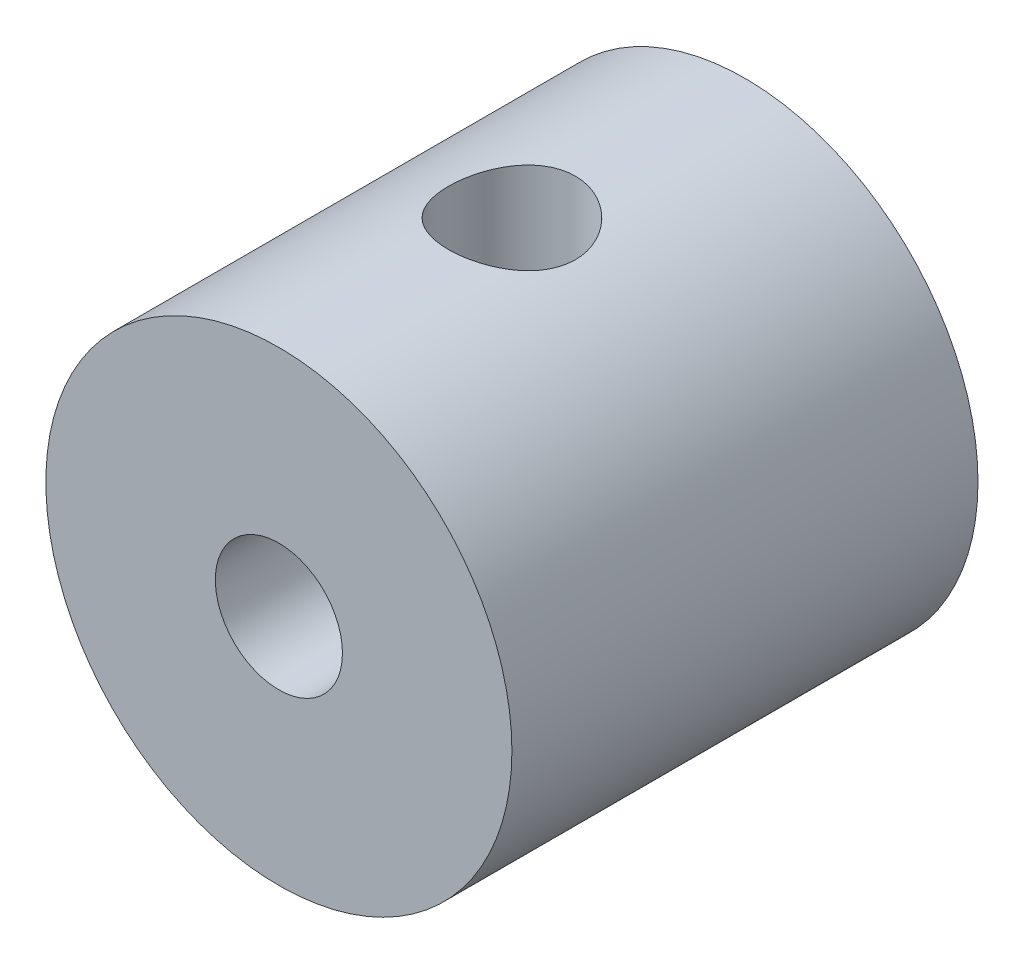
ISO-10303-21;
HEADER;
FILE_DESCRIPTION(('STEP AP214'),'2;1');
FILE_NAME('part.step','',(''),(''),'','','');
FILE_SCHEMA(('AUTOMOTIVE_DESIGN { 1 0 10303 214 1 1 1 1 }'));
ENDSEC;
DATA;
#1=APPLICATION_CONTEXT('core data for automotive mechanical design processes');
#2=APPLICATION_PROTOCOL_DEFINITION('international standard','automotive_design',2000,#1);
#3=PRODUCT_CONTEXT('',#1,'mechanical');
#4=PRODUCT('Part','Part','',(#3));
#5=PRODUCT_RELATED_PRODUCT_CATEGORY('part','',(#4));
#6=PRODUCT_DEFINITION_FORMATION('','',#4);
#7=PRODUCT_DEFINITION_CONTEXT('part definition',#1,'design');
#8=PRODUCT_DEFINITION('design','',#6,#7);
#9=PRODUCT_DEFINITION_SHAPE('','',#8);
#10=(LENGTH_UNIT() NAMED_UNIT(*) SI_UNIT(.MILLI.,.METRE.));
#11=(NAMED_UNIT(*) PLANE_ANGLE_UNIT() SI_UNIT($,.RADIAN.));
#12=(NAMED_UNIT(*) SI_UNIT($,.STERADIAN.) SOLID_ANGLE_UNIT());
#13=UNCERTAINTY_MEASURE_WITH_UNIT(LENGTH_MEASURE(1.E-05),#10,'distance_accuracy_value','');
#14=(GEOMETRIC_REPRESENTATION_CONTEXT(3) GLOBAL_UNCERTAINTY_ASSIGNED_CONTEXT((#13)) GLOBAL_UNIT_ASSIGNED_CONTEXT((#10,
#11,#12)) REPRESENTATION_CONTEXT('',''));
#15=CARTESIAN_POINT('',(0.,0.,0.));
#16=DIRECTION('',(0.,0.,1.));
#17=DIRECTION('',(1.,0.,0.));
#18=AXIS2_PLACEMENT_3D('',#15,#16,#17);
#19=CARTESIAN_POINT('',(0.,0.,5.5));
#20=DIRECTION('',(0.,0.,-1.));
#21=DIRECTION('',(-1.,0.,0.));
#22=AXIS2_PLACEMENT_3D('',#19,#20,#21);
#23=CYLINDRICAL_SURFACE('',#22,0.75);
#24=CARTESIAN_POINT('',(0.,0.,2.75));
#25=DIRECTION('',(0.,0.707106781186547,-0.707106781186547));
#26=DIRECTION('',(0.,-0.707106781186547,-0.707106781186547));
#27=AXIS2_PLACEMENT_3D('',#24,#25,#26);
#28=ELLIPSE('',#27,1.06066017177982,0.75);
#29=CARTESIAN_POINT('',(0.75,0.,2.75));
#30=VERTEX_POINT('',#29);
#31=CARTESIAN_POINT('',(-0.750000000000001,0.,2.75));
#32=VERTEX_POINT('',#31);
#33=EDGE_CURVE('E11',#30,#32,#28,.F.);
#34=ORIENTED_EDGE('',*,*,#33,.F.);
#35=CARTESIAN_POINT('',(0.,0.,2.75));
#36=DIRECTION('',(0.,-0.707106781186547,-0.707106781186547));
#37=DIRECTION('',(0.,0.707106781186547,-0.707106781186547));
#38=AXIS2_PLACEMENT_3D('',#35,#36,#37);
#39=ELLIPSE('',#38,1.06066017177982,0.75);
#40=EDGE_CURVE('E49',#32,#30,#39,.F.);
#41=ORIENTED_EDGE('',*,*,#40,.F.);
#42=EDGE_LOOP('',(#34,#41));
#43=FACE_BOUND('',#42,.T.);
#44=CARTESIAN_POINT('',(0.,0.,5.5));
#45=DIRECTION('',(0.,0.,1.));
#46=DIRECTION('',(1.,0.,0.));
#47=AXIS2_PLACEMENT_3D('',#44,#45,#46);
#48=CIRCLE('',#47,0.75);
#49=CARTESIAN_POINT('',(0.75,0.,5.5));
#50=VERTEX_POINT('',#49);
#51=EDGE_CURVE('E72',#50,#50,#48,.T.);
#52=ORIENTED_EDGE('',*,*,#51,.T.);
#53=EDGE_LOOP('',(#52));
#54=FACE_BOUND('',#53,.T.);
#55=ADVANCED_FACE('F34',(#43,#54),#23,.F.);
#56=CARTESIAN_POINT('',(0.,0.,5.5));
#57=DIRECTION('',(0.,0.,1.));
#58=DIRECTION('',(1.,0.,0.));
#59=AXIS2_PLACEMENT_3D('',#56,#57,#58);
#60=PLANE('',#59);
#61=CARTESIAN_POINT('',(0.,0.,5.5));
#62=DIRECTION('',(0.,0.,1.));
#63=DIRECTION('',(1.,0.,0.));
#64=AXIS2_PLACEMENT_3D('',#61,#62,#63);
#65=CIRCLE('',#64,2.75);
#66=CARTESIAN_POINT('',(2.75,0.,5.5));
#67=VERTEX_POINT('',#66);
#68=EDGE_CURVE('E63',#67,#67,#65,.T.);
#69=ORIENTED_EDGE('',*,*,#68,.T.);
#70=EDGE_LOOP('',(#69));
#71=FACE_BOUND('',#70,.T.);
#72=ORIENTED_EDGE('',*,*,#51,.F.);
#73=EDGE_LOOP('',(#72));
#74=FACE_BOUND('',#73,.T.);
#75=ADVANCED_FACE('F97',(#71,#74),#60,.T.);
#76=CARTESIAN_POINT('',(0.,0.,0.));
#77=DIRECTION('',(0.,0.,1.));
#78=DIRECTION('',(1.,0.,0.));
#79=AXIS2_PLACEMENT_3D('',#76,#77,#78);
#80=PLANE('',#79);
#81=CARTESIAN_POINT('',(0.,0.,0.));
#82=DIRECTION('',(0.,0.,1.));
#83=DIRECTION('',(1.,0.,0.));
#84=AXIS2_PLACEMENT_3D('',#81,#82,#83);
#85=CIRCLE('',#84,2.75);
#86=CARTESIAN_POINT('',(2.75,0.,0.));
#87=VERTEX_POINT('',#86);
#88=EDGE_CURVE('E69',#87,#87,#85,.T.);
#89=ORIENTED_EDGE('',*,*,#88,.F.);
#90=EDGE_LOOP('',(#89));
#91=FACE_BOUND('',#90,.T.);
#92=CARTESIAN_POINT('',(0.,0.,0.));
#93=DIRECTION('',(0.,0.,1.));
#94=DIRECTION('',(1.,0.,0.));
#95=AXIS2_PLACEMENT_3D('',#92,#93,#94);
#96=CIRCLE('',#95,0.75);
#97=CARTESIAN_POINT('',(0.75,0.,0.));
#98=VERTEX_POINT('',#97);
#99=EDGE_CURVE('E75',#98,#98,#96,.T.);
#100=ORIENTED_EDGE('',*,*,#99,.T.);
#101=EDGE_LOOP('',(#100));
#102=FACE_BOUND('',#101,.T.);
#103=ADVANCED_FACE('F99',(#91,#102),#80,.F.);
#104=CARTESIAN_POINT('',(0.,0.,5.5));
#105=DIRECTION('',(0.,0.,-1.));
#106=DIRECTION('',(-1.,0.,0.));
#107=AXIS2_PLACEMENT_3D('',#104,#105,#106);
#108=CYLINDRICAL_SURFACE('',#107,2.75);
#109=CARTESIAN_POINT('',(0.,-2.75,3.5));
#110=CARTESIAN_POINT('',(0.041310456666096,-2.74999941358706,3.49999909369449));
#111=CARTESIAN_POINT('',(0.0826304894063532,-2.74906003630382,3.49657546820829));
#112=CARTESIAN_POINT('',(0.164077965078848,-2.74540399042724,3.48299708484841));
#113=CARTESIAN_POINT('',(0.204204863988631,-2.74268652370244,3.4728393041857));
#114=CARTESIAN_POINT('',(0.282078813027697,-2.73577386087073,3.44614913413079));
#115=CARTESIAN_POINT('',(0.319828933485082,-2.73158061934716,3.42962517366904));
#116=CARTESIAN_POINT('',(0.392022248079858,-2.72215827206405,3.39070353366879));
#117=CARTESIAN_POINT('',(0.426465181644885,-2.71692908478188,3.36830539182306));
#118=CARTESIAN_POINT('',(0.491898473786633,-2.70585698521101,3.31770008176635));
#119=CARTESIAN_POINT('',(0.52279756458498,-2.70000320745485,3.28937727957281));
#120=CARTESIAN_POINT('',(0.579471468412378,-2.68841056467261,3.22797368198514));
#121=CARTESIAN_POINT('',(0.605245589123563,-2.68267171526591,3.19489224479917));
#122=CARTESIAN_POINT('',(0.651388972697531,-2.67184692082858,3.12417437620993));
#123=CARTESIAN_POINT('',(0.671652134188099,-2.66677465033183,3.08646642753061));
#124=CARTESIAN_POINT('',(0.705514581805969,-2.65801753702088,3.00801808590157));
#125=CARTESIAN_POINT('',(0.719115159733594,-2.65433242528424,2.96727828256044));
#126=CARTESIAN_POINT('',(0.738947282206019,-2.64887923610509,2.88493605249306));
#127=CARTESIAN_POINT('',(0.745344802717187,-2.64706806194024,2.84337652591006));
#128=CARTESIAN_POINT('',(0.751106822046827,-2.64543914593961,2.75973765848456));
#129=CARTESIAN_POINT('',(0.750472700704347,-2.64562101300361,2.71765842124518));
#130=CARTESIAN_POINT('',(0.742320958901175,-2.6479191242441,2.63547922451759));
#131=CARTESIAN_POINT('',(0.735005368344572,-2.64997859153265,2.59535738269908));
#132=CARTESIAN_POINT('',(0.714022419359122,-2.655708779006,2.5169333569884));
#133=CARTESIAN_POINT('',(0.70035453252326,-2.65937963323038,2.4786313247668));
#134=CARTESIAN_POINT('',(0.666893149132326,-2.6679680914519,2.40441323972632));
#135=CARTESIAN_POINT('',(0.64702975941473,-2.67289979881809,2.3685303994832));
#136=CARTESIAN_POINT('',(0.601789940110875,-2.68344684399157,2.30053677629515));
#137=CARTESIAN_POINT('',(0.576412380531045,-2.68906232181696,2.26842676858063));
#138=CARTESIAN_POINT('',(0.519836733414477,-2.70057947495229,2.20773740509679));
#139=CARTESIAN_POINT('',(0.488469323083624,-2.70648437148538,2.17931627535553));
#140=CARTESIAN_POINT('',(0.421341005894317,-2.71774323854009,2.12810451751111));
#141=CARTESIAN_POINT('',(0.385579909859276,-2.72309718532152,2.10531413197519));
#142=CARTESIAN_POINT('',(0.31042697686981,-2.73268639060625,2.06593666361254));
#143=CARTESIAN_POINT('',(0.271018818708885,-2.73691625643651,2.04937933070803));
#144=CARTESIAN_POINT('',(0.189836344357194,-2.74374178071307,2.02317101374293));
#145=CARTESIAN_POINT('',(0.14806257215884,-2.74633781322282,2.01351844877793));
#146=CARTESIAN_POINT('',(0.0646840852416241,-2.74954614388156,2.00164469110151));
#147=CARTESIAN_POINT('',(0.0231121488919887,-2.75021581562686,1.99920850233982));
#148=CARTESIAN_POINT('',(-0.0598466828189875,-2.74966150792568,2.00124137375671));
#149=CARTESIAN_POINT('',(-0.101233597766255,-2.74843773391499,2.00570968480824));
#150=CARTESIAN_POINT('',(-0.181872548869779,-2.74427119632979,2.02124875135157));
#151=CARTESIAN_POINT('',(-0.221149662136339,-2.74135993236064,2.0321985963785));
#152=CARTESIAN_POINT('',(-0.297304933724317,-2.73414961767822,2.06024862232024));
#153=CARTESIAN_POINT('',(-0.334182825652499,-2.72985041317236,2.07734948483064));
#154=CARTESIAN_POINT('',(-0.405320580597296,-2.72020786914138,2.11760822114284));
#155=CARTESIAN_POINT('',(-0.439512301206293,-2.7148451477494,2.14088174363078));
#156=CARTESIAN_POINT('',(-0.50358011006541,-2.70369494205017,2.19268064377262));
#157=CARTESIAN_POINT('',(-0.533455303088816,-2.69790737000524,2.22120710807876));
#158=CARTESIAN_POINT('',(-0.588955301721564,-2.68634700779248,2.28370701901744));
#159=CARTESIAN_POINT('',(-0.61442813873611,-2.68057972491943,2.31781669113948));
#160=CARTESIAN_POINT('',(-0.6592929110398,-2.66990013093907,2.38994932360963));
#161=CARTESIAN_POINT('',(-0.678685089629618,-2.6649877856273,2.42797212730376));
#162=CARTESIAN_POINT('',(-0.710692791586048,-2.65663124351908,2.50667031412098));
#163=CARTESIAN_POINT('',(-0.723346761534928,-2.65317874101126,2.54732913026261));
#164=CARTESIAN_POINT('',(-0.741604586103459,-2.64813407348094,2.63030841901378));
#165=CARTESIAN_POINT('',(-0.747210344315742,-2.64654140615938,2.67262843977683));
#166=CARTESIAN_POINT('',(-0.75109947788454,-2.64544004835881,2.75616920190872));
#167=CARTESIAN_POINT('',(-0.749627666085129,-2.64586168000794,2.79737779436125));
#168=CARTESIAN_POINT('',(-0.73997418821988,-2.64857750868493,2.87893532386749));
#169=CARTESIAN_POINT('',(-0.731792710142834,-2.65087165324946,2.91928428497352));
#170=CARTESIAN_POINT('',(-0.709097042175596,-2.65703158245899,2.99765315788806));
#171=CARTESIAN_POINT('',(-0.694636977245637,-2.66088391562909,3.03568987662088));
#172=CARTESIAN_POINT('',(-0.659836522706929,-2.66972594993982,3.10882663840667));
#173=CARTESIAN_POINT('',(-0.639495172522282,-2.67471583684613,3.14392620053259));
#174=CARTESIAN_POINT('',(-0.592777154924258,-2.68546189690907,3.21135529884632));
#175=CARTESIAN_POINT('',(-0.566234509110625,-2.6912368792263,3.24356685242156));
#176=CARTESIAN_POINT('',(-0.508180055996369,-2.70279995245427,3.3031582033973));
#177=CARTESIAN_POINT('',(-0.476667029693998,-2.70858804623652,3.33053681200267));
#178=CARTESIAN_POINT('',(-0.40870386284304,-2.71968229588679,3.3802973072597));
#179=CARTESIAN_POINT('',(-0.37215793313126,-2.72497453876903,3.40255174043349));
#180=CARTESIAN_POINT('',(-0.29569994991964,-2.73432631890201,3.44056621810574));
#181=CARTESIAN_POINT('',(-0.255789976210611,-2.73838661075599,3.45633024027716));
#182=CARTESIAN_POINT('',(-0.180050050609106,-2.74432096997879,3.4789697549895));
#183=CARTESIAN_POINT('',(-0.144532320131234,-2.74643473840546,3.48683727562085));
#184=CARTESIAN_POINT('',(-0.0726788039707427,-2.74927443582177,3.49735251265941));
#185=CARTESIAN_POINT('',(-0.0363431077824743,-2.7500005159001,3.5000007973274));
#186=CARTESIAN_POINT('',(0.,-2.75,3.5));
#187=B_SPLINE_CURVE_WITH_KNOTS('',3,(#109,#110,#111,#112,#113,#114,#115,#116,#117,#118,#119,
#120,#121,#122,#123,#124,#125,#126,#127,#128,#129,#130,#131,#132,#133,#134,#135,#136,#137,#138,
#139,#140,#141,#142,#143,#144,#145,#146,#147,#148,#149,#150,#151,#152,#153,#154,#155,#156,#157,
#158,#159,#160,#161,#162,#163,#164,#165,#166,#167,#168,#169,#170,#171,#172,#173,#174,#175,#176,
#177,#178,#179,#180,#181,#182,#183,#184,#185,#186),.UNSPECIFIED.,.T.,.F.,(4,2,2,2,2,2,2,2,2,2,2,
2,2,2,2,2,2,2,2,2,2,2,2,2,2,2,2,2,2,2,2,2,2,2,2,2,2,2,4),(0.,0.123798053427449,0.24765171427565,
0.37134195121029,0.495041925682353,0.621429391115893,0.747833918296619,0.876522968251097,
1.00518705695498,1.1308215242927,1.25643133845851,1.37836443335025,1.50030767289441,
1.62367963381546,1.74707690067143,1.8746926427297,2.00231388139794,2.13053674865596,
2.25873024881054,2.38306405669123,2.50738437550207,2.6294555559768,2.751540267355,
2.87609734502423,3.00068021825584,3.12895036530017,3.25721537931538,3.38474048225284,
3.51223113559687,3.63534426111897,3.75845393742376,3.88052277825491,4.00261156756375,
4.12844505693628,4.25430945550069,4.38302936142112,4.511670263013,4.62059416044177,
4.72950619778235),.UNSPECIFIED.);
#188=CARTESIAN_POINT('',(0.,-2.75,3.5));
#189=VERTEX_POINT('',#188);
#190=EDGE_CURVE('E78',#189,#189,#187,.T.);
#191=ORIENTED_EDGE('',*,*,#190,.T.);
#192=EDGE_LOOP('',(#191));
#193=FACE_BOUND('',#192,.T.);
#194=CARTESIAN_POINT('',(0.,2.75,3.5));
#195=CARTESIAN_POINT('',(-0.0413104566660967,2.74999941358706,3.49999909369449));
#196=CARTESIAN_POINT('',(-0.0826304894063539,2.74906003630382,3.49657546820829));
#197=CARTESIAN_POINT('',(-0.164077965078849,2.74540399042724,3.48299708484841));
#198=CARTESIAN_POINT('',(-0.204204863988632,2.74268652370244,3.4728393041857));
#199=CARTESIAN_POINT('',(-0.282078813027698,2.73577386087073,3.44614913413079));
#200=CARTESIAN_POINT('',(-0.319828933485082,2.73158061934716,3.42962517366904));
#201=CARTESIAN_POINT('',(-0.392022248079859,2.72215827206405,3.3907035336688));
#202=CARTESIAN_POINT('',(-0.426465181644886,2.71692908478188,3.36830539182306));
#203=CARTESIAN_POINT('',(-0.491898473786634,2.70585698521101,3.31770008176635));
#204=CARTESIAN_POINT('',(-0.522797564584981,2.70000320745485,3.28937727957281));
#205=CARTESIAN_POINT('',(-0.579471468412379,2.68841056467261,3.22797368198514));
#206=CARTESIAN_POINT('',(-0.605245589123564,2.68267171526591,3.19489224479917));
#207=CARTESIAN_POINT('',(-0.651388972697532,2.67184692082858,3.12417437620993));
#208=CARTESIAN_POINT('',(-0.671652134188101,2.66677465033183,3.08646642753061));
#209=CARTESIAN_POINT('',(-0.705514581805971,2.65801753702088,3.00801808590157));
#210=CARTESIAN_POINT('',(-0.719115159733595,2.65433242528424,2.96727828256044));
#211=CARTESIAN_POINT('',(-0.738947282206021,2.64887923610509,2.88493605249306));
#212=CARTESIAN_POINT('',(-0.745344802717189,2.64706806194024,2.84337652591006));
#213=CARTESIAN_POINT('',(-0.751106822046829,2.64543914593961,2.75973765848457));
#214=CARTESIAN_POINT('',(-0.750472700704349,2.64562101300361,2.71765842124518));
#215=CARTESIAN_POINT('',(-0.742320958901177,2.6479191242441,2.63547922451759));
#216=CARTESIAN_POINT('',(-0.735005368344574,2.64997859153265,2.59535738269908));
#217=CARTESIAN_POINT('',(-0.714022419359124,2.655708779006,2.5169333569884));
#218=CARTESIAN_POINT('',(-0.700354532523262,2.65937963323038,2.4786313247668));
#219=CARTESIAN_POINT('',(-0.666893149132329,2.6679680914519,2.40441323972633));
#220=CARTESIAN_POINT('',(-0.647029759414732,2.67289979881809,2.3685303994832));
#221=CARTESIAN_POINT('',(-0.601789940110877,2.68344684399157,2.30053677629515));
#222=CARTESIAN_POINT('',(-0.576412380531047,2.68906232181696,2.26842676858063));
#223=CARTESIAN_POINT('',(-0.51983673341448,2.70057947495229,2.20773740509679));
#224=CARTESIAN_POINT('',(-0.488469323083627,2.70648437148538,2.17931627535553));
#225=CARTESIAN_POINT('',(-0.42134100589432,2.71774323854009,2.12810451751111));
#226=CARTESIAN_POINT('',(-0.385579909859279,2.72309718532152,2.10531413197519));
#227=CARTESIAN_POINT('',(-0.310426976869814,2.73268639060625,2.06593666361254));
#228=CARTESIAN_POINT('',(-0.271018818708888,2.73691625643651,2.04937933070803));
#229=CARTESIAN_POINT('',(-0.189836344357197,2.74374178071307,2.02317101374293));
#230=CARTESIAN_POINT('',(-0.148062572158843,2.74633781322282,2.01351844877793));
#231=CARTESIAN_POINT('',(-0.0646840852416271,2.74954614388156,2.00164469110151));
#232=CARTESIAN_POINT('',(-0.0231121488919917,2.75021581562686,1.99920850233982));
#233=CARTESIAN_POINT('',(0.0598466828189845,2.74966150792568,2.00124137375671));
#234=CARTESIAN_POINT('',(0.101233597766252,2.74843773391499,2.00570968480824));
#235=CARTESIAN_POINT('',(0.181872548869776,2.74427119632979,2.02124875135157));
#236=CARTESIAN_POINT('',(0.221149662136337,2.74135993236064,2.0321985963785));
#237=CARTESIAN_POINT('',(0.297304933724314,2.73414961767822,2.06024862232024));
#238=CARTESIAN_POINT('',(0.334182825652497,2.72985041317236,2.07734948483064));
#239=CARTESIAN_POINT('',(0.405320580597293,2.72020786914138,2.11760822114284));
#240=CARTESIAN_POINT('',(0.43951230120629,2.7148451477494,2.14088174363078));
#241=CARTESIAN_POINT('',(0.503580110065407,2.70369494205017,2.19268064377262));
#242=CARTESIAN_POINT('',(0.533455303088813,2.69790737000524,2.22120710807876));
#243=CARTESIAN_POINT('',(0.588955301721561,2.68634700779248,2.28370701901744));
#244=CARTESIAN_POINT('',(0.614428138736107,2.68057972491943,2.31781669113948));
#245=CARTESIAN_POINT('',(0.659292911039797,2.66990013093907,2.38994932360962));
#246=CARTESIAN_POINT('',(0.678685089629616,2.66498778562731,2.42797212730376));
#247=CARTESIAN_POINT('',(0.710692791586046,2.65663124351908,2.50667031412098));
#248=CARTESIAN_POINT('',(0.723346761534926,2.65317874101126,2.54732913026261));
#249=CARTESIAN_POINT('',(0.741604586103457,2.64813407348094,2.63030841901378));
#250=CARTESIAN_POINT('',(0.74721034431574,2.64654140615938,2.67262843977683));
#251=CARTESIAN_POINT('',(0.751099477884538,2.64544004835881,2.75616920190872));
#252=CARTESIAN_POINT('',(0.749627666085127,2.64586168000794,2.79737779436125));
#253=CARTESIAN_POINT('',(0.739974188219879,2.64857750868493,2.87893532386748));
#254=CARTESIAN_POINT('',(0.731792710142833,2.65087165324946,2.91928428497352));
#255=CARTESIAN_POINT('',(0.709097042175595,2.65703158245899,2.99765315788806));
#256=CARTESIAN_POINT('',(0.694636977245636,2.66088391562909,3.03568987662088));
#257=CARTESIAN_POINT('',(0.659836522706927,2.66972594993982,3.10882663840667));
#258=CARTESIAN_POINT('',(0.639495172522281,2.67471583684614,3.14392620053258));
#259=CARTESIAN_POINT('',(0.592777154924256,2.68546189690907,3.21135529884632));
#260=CARTESIAN_POINT('',(0.566234509110624,2.6912368792263,3.24356685242156));
#261=CARTESIAN_POINT('',(0.508180055996368,2.70279995245427,3.3031582033973));
#262=CARTESIAN_POINT('',(0.476667029693997,2.70858804623652,3.33053681200267));
#263=CARTESIAN_POINT('',(0.408703862843039,2.71968229588679,3.3802973072597));
#264=CARTESIAN_POINT('',(0.372157933131259,2.72497453876903,3.40255174043349));
#265=CARTESIAN_POINT('',(0.295699949919639,2.73432631890201,3.44056621810574));
#266=CARTESIAN_POINT('',(0.25578997621061,2.73838661075599,3.45633024027716));
#267=CARTESIAN_POINT('',(0.180050050609105,2.74432096997879,3.4789697549895));
#268=CARTESIAN_POINT('',(0.144532320131234,2.74643473840546,3.48683727562085));
#269=CARTESIAN_POINT('',(0.0726788039707418,2.74927443582177,3.49735251265941));
#270=CARTESIAN_POINT('',(0.0363431077824734,2.7500005159001,3.5000007973274));
#271=CARTESIAN_POINT('',(0.,2.75,3.5));
#272=B_SPLINE_CURVE_WITH_KNOTS('',3,(#194,#195,#196,#197,#198,#199,#200,#201,#202,#203,#204,
#205,#206,#207,#208,#209,#210,#211,#212,#213,#214,#215,#216,#217,#218,#219,#220,#221,#222,#223,
#224,#225,#226,#227,#228,#229,#230,#231,#232,#233,#234,#235,#236,#237,#238,#239,#240,#241,#242,
#243,#244,#245,#246,#247,#248,#249,#250,#251,#252,#253,#254,#255,#256,#257,#258,#259,#260,#261,
#262,#263,#264,#265,#266,#267,#268,#269,#270,#271),.UNSPECIFIED.,.T.,.F.,(4,2,2,2,2,2,2,2,2,2,2,
2,2,2,2,2,2,2,2,2,2,2,2,2,2,2,2,2,2,2,2,2,2,2,2,2,2,2,4),(0.,0.123798053427448,0.24765171427565,
0.371341951210289,0.495041925682353,0.621429391115893,0.747833918296619,0.876522968251097,
1.00518705695498,1.1308215242927,1.25643133845851,1.37836443335025,1.50030767289441,
1.62367963381546,1.74707690067143,1.8746926427297,2.00231388139794,2.13053674865596,
2.25873024881054,2.38306405669123,2.50738437550207,2.6294555559768,2.751540267355,
2.87609734502423,3.00068021825584,3.12895036530017,3.25721537931538,3.38474048225284,
3.51223113559687,3.63534426111897,3.75845393742376,3.88052277825491,4.00261156756375,
4.12844505693628,4.25430945550069,4.38302936142112,4.511670263013,4.62059416044177,
4.72950619778235),.UNSPECIFIED.);
#273=CARTESIAN_POINT('',(0.,2.75,3.5));
#274=VERTEX_POINT('',#273);
#275=EDGE_CURVE('E87',#274,#274,#272,.T.);
#276=ORIENTED_EDGE('',*,*,#275,.T.);
#277=EDGE_LOOP('',(#276));
#278=FACE_BOUND('',#277,.T.);
#279=ORIENTED_EDGE('',*,*,#68,.F.);
#280=EDGE_LOOP('',(#279));
#281=FACE_BOUND('',#280,.T.);
#282=ORIENTED_EDGE('',*,*,#88,.T.);
#283=EDGE_LOOP('',(#282));
#284=FACE_BOUND('',#283,.T.);
#285=ADVANCED_FACE('F36',(#193,#278,#281,#284),#108,.T.);
#286=CARTESIAN_POINT('',(0.,0.,2.75));
#287=DIRECTION('',(0.,0.707106781186547,-0.707106781186547));
#288=DIRECTION('',(0.,-0.707106781186547,-0.707106781186547));
#289=AXIS2_PLACEMENT_3D('',#286,#287,#288);
#290=ELLIPSE('',#289,1.06066017177982,0.75);
#291=EDGE_CURVE('E43',#30,#32,#290,.T.);
#292=ORIENTED_EDGE('',*,*,#291,.F.);
#293=CARTESIAN_POINT('',(0.,0.,2.75));
#294=DIRECTION('',(0.,-0.707106781186547,-0.707106781186547));
#295=DIRECTION('',(0.,0.707106781186547,-0.707106781186547));
#296=AXIS2_PLACEMENT_3D('',#293,#294,#295);
#297=ELLIPSE('',#296,1.06066017177982,0.75);
#298=EDGE_CURVE('E54',#32,#30,#297,.T.);
#299=ORIENTED_EDGE('',*,*,#298,.F.);
#300=EDGE_LOOP('',(#292,#299));
#301=FACE_BOUND('',#300,.T.);
#302=ORIENTED_EDGE('',*,*,#99,.F.);
#303=EDGE_LOOP('',(#302));
#304=FACE_BOUND('',#303,.T.);
#305=ADVANCED_FACE('F66',(#301,#304),#23,.F.);
#306=CARTESIAN_POINT('',(0.,-2.75,2.75));
#307=DIRECTION('',(0.,1.,0.));
#308=DIRECTION('',(0.,0.,1.));
#309=AXIS2_PLACEMENT_3D('',#306,#307,#308);
#310=CYLINDRICAL_SURFACE('',#309,0.75);
#311=ORIENTED_EDGE('',*,*,#291,.T.);
#312=ORIENTED_EDGE('',*,*,#40,.T.);
#313=EDGE_LOOP('',(#311,#312));
#314=FACE_BOUND('',#313,.T.);
#315=ORIENTED_EDGE('',*,*,#190,.F.);
#316=EDGE_LOOP('',(#315));
#317=FACE_BOUND('',#316,.T.);
#318=ADVANCED_FACE('F61',(#314,#317),#310,.F.);
#319=ORIENTED_EDGE('',*,*,#33,.T.);
#320=ORIENTED_EDGE('',*,*,#298,.T.);
#321=EDGE_LOOP('',(#319,#320));
#322=FACE_BOUND('',#321,.T.);
#323=ORIENTED_EDGE('',*,*,#275,.F.);
#324=EDGE_LOOP('',(#323));
#325=FACE_BOUND('',#324,.T.);
#326=ADVANCED_FACE('F55',(#322,#325),#310,.F.);
#327=CLOSED_SHELL('',(#55,#75,#103,#285,#305,#318,#326));
#328=MANIFOLD_SOLID_BREP('B2',#327);
#329=ADVANCED_BREP_SHAPE_REPRESENTATION('',(#18,#328),#14);
#330=SHAPE_DEFINITION_REPRESENTATION(#9,#329);
ENDSEC;
END-ISO-10303-21;
